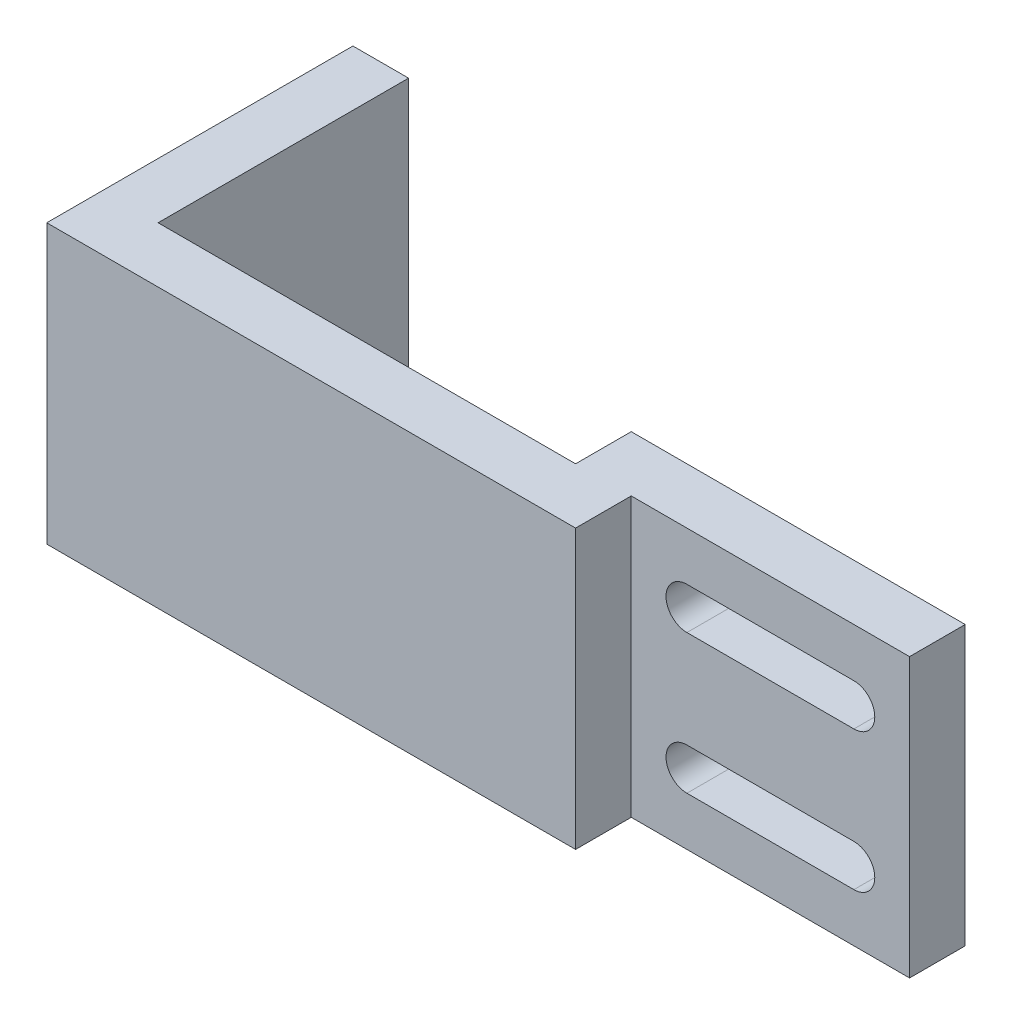
ISO-10303-21;
HEADER;
FILE_DESCRIPTION(('STEP AP214'),'2;1');
FILE_NAME('part.step','',(''),(''),'','','');
FILE_SCHEMA(('AUTOMOTIVE_DESIGN { 1 0 10303 214 1 1 1 1 }'));
ENDSEC;
DATA;
#1=APPLICATION_CONTEXT('core data for automotive mechanical design processes');
#2=APPLICATION_PROTOCOL_DEFINITION('international standard','automotive_design',2000,#1);
#3=PRODUCT_CONTEXT('',#1,'mechanical');
#4=PRODUCT('Part','Part','',(#3));
#5=PRODUCT_RELATED_PRODUCT_CATEGORY('part','',(#4));
#6=PRODUCT_DEFINITION_FORMATION('','',#4);
#7=PRODUCT_DEFINITION_CONTEXT('part definition',#1,'design');
#8=PRODUCT_DEFINITION('design','',#6,#7);
#9=PRODUCT_DEFINITION_SHAPE('','',#8);
#10=(LENGTH_UNIT() NAMED_UNIT(*) SI_UNIT(.MILLI.,.METRE.));
#11=(NAMED_UNIT(*) PLANE_ANGLE_UNIT() SI_UNIT($,.RADIAN.));
#12=(NAMED_UNIT(*) SI_UNIT($,.STERADIAN.) SOLID_ANGLE_UNIT());
#13=UNCERTAINTY_MEASURE_WITH_UNIT(LENGTH_MEASURE(1.E-05),#10,'distance_accuracy_value','');
#14=(GEOMETRIC_REPRESENTATION_CONTEXT(3) GLOBAL_UNCERTAINTY_ASSIGNED_CONTEXT((#13)) GLOBAL_UNIT_ASSIGNED_CONTEXT((#10,
#11,#12)) REPRESENTATION_CONTEXT('',''));
#15=CARTESIAN_POINT('',(0.,0.,0.));
#16=DIRECTION('',(0.,0.,1.));
#17=DIRECTION('',(1.,0.,0.));
#18=AXIS2_PLACEMENT_3D('',#15,#16,#17);
#19=CARTESIAN_POINT('',(-19.,20.,0.));
#20=DIRECTION('',(1.,0.,0.));
#21=DIRECTION('',(0.,0.,-1.));
#22=AXIS2_PLACEMENT_3D('',#19,#20,#21);
#23=PLANE('',#22);
#24=DIRECTION('',(0.,0.,1.));
#25=VECTOR('',#24,1.);
#26=CARTESIAN_POINT('',(-19.,0.,0.));
#27=LINE('',#26,#25);
#28=CARTESIAN_POINT('',(-19.,0.,-22.));
#29=VERTEX_POINT('',#28);
#30=CARTESIAN_POINT('',(-19.,0.,0.));
#31=VERTEX_POINT('',#30);
#32=EDGE_CURVE('E187',#29,#31,#27,.T.);
#33=ORIENTED_EDGE('',*,*,#32,.T.);
#34=DIRECTION('',(0.,-1.,0.));
#35=VECTOR('',#34,1.);
#36=CARTESIAN_POINT('',(-19.,20.,0.));
#37=LINE('',#36,#35);
#38=CARTESIAN_POINT('',(-19.,20.,0.));
#39=VERTEX_POINT('',#38);
#40=EDGE_CURVE('E276',#39,#31,#37,.T.);
#41=ORIENTED_EDGE('',*,*,#40,.F.);
#42=DIRECTION('',(0.,0.,1.));
#43=VECTOR('',#42,1.);
#44=CARTESIAN_POINT('',(-19.,20.,0.));
#45=LINE('',#44,#43);
#46=CARTESIAN_POINT('',(-19.,20.,-22.));
#47=VERTEX_POINT('',#46);
#48=EDGE_CURVE('E208',#47,#39,#45,.T.);
#49=ORIENTED_EDGE('',*,*,#48,.F.);
#50=DIRECTION('',(0.,-1.,0.));
#51=VECTOR('',#50,1.);
#52=CARTESIAN_POINT('',(-19.,20.,-22.));
#53=LINE('',#52,#51);
#54=EDGE_CURVE('E230',#47,#29,#53,.T.);
#55=ORIENTED_EDGE('',*,*,#54,.T.);
#56=EDGE_LOOP('',(#33,#41,#49,#55));
#57=FACE_BOUND('',#56,.T.);
#58=ADVANCED_FACE('F32',(#57),#23,.F.);
#59=CARTESIAN_POINT('',(19.,20.,0.));
#60=DIRECTION('',(0.,0.,-1.));
#61=DIRECTION('',(-1.,0.,0.));
#62=AXIS2_PLACEMENT_3D('',#59,#60,#61);
#63=PLANE('',#62);
#64=DIRECTION('',(1.,0.,0.));
#65=VECTOR('',#64,1.);
#66=CARTESIAN_POINT('',(19.,0.,0.));
#67=LINE('',#66,#65);
#68=CARTESIAN_POINT('',(19.,0.,0.));
#69=VERTEX_POINT('',#68);
#70=EDGE_CURVE('E233',#31,#69,#67,.T.);
#71=ORIENTED_EDGE('',*,*,#70,.T.);
#72=DIRECTION('',(0.,-1.,0.));
#73=VECTOR('',#72,1.);
#74=CARTESIAN_POINT('',(19.,20.,0.));
#75=LINE('',#74,#73);
#76=CARTESIAN_POINT('',(19.,20.,0.));
#77=VERTEX_POINT('',#76);
#78=EDGE_CURVE('E273',#77,#69,#75,.T.);
#79=ORIENTED_EDGE('',*,*,#78,.F.);
#80=DIRECTION('',(1.,0.,0.));
#81=VECTOR('',#80,1.);
#82=CARTESIAN_POINT('',(19.,20.,0.));
#83=LINE('',#82,#81);
#84=EDGE_CURVE('E211',#39,#77,#83,.T.);
#85=ORIENTED_EDGE('',*,*,#84,.F.);
#86=ORIENTED_EDGE('',*,*,#40,.T.);
#87=EDGE_LOOP('',(#71,#79,#85,#86));
#88=FACE_BOUND('',#87,.T.);
#89=ADVANCED_FACE('F315',(#88),#63,.F.);
#90=CARTESIAN_POINT('',(19.,20.,-4.));
#91=DIRECTION('',(-1.,0.,0.));
#92=DIRECTION('',(0.,0.,1.));
#93=AXIS2_PLACEMENT_3D('',#90,#91,#92);
#94=PLANE('',#93);
#95=DIRECTION('',(0.,0.,-1.));
#96=VECTOR('',#95,1.);
#97=CARTESIAN_POINT('',(19.,0.,-4.));
#98=LINE('',#97,#96);
#99=CARTESIAN_POINT('',(19.,0.,-4.));
#100=VERTEX_POINT('',#99);
#101=EDGE_CURVE('E235',#69,#100,#98,.T.);
#102=ORIENTED_EDGE('',*,*,#101,.T.);
#103=DIRECTION('',(0.,-1.,0.));
#104=VECTOR('',#103,1.);
#105=CARTESIAN_POINT('',(19.,20.,-4.));
#106=LINE('',#105,#104);
#107=CARTESIAN_POINT('',(19.,20.,-4.));
#108=VERTEX_POINT('',#107);
#109=EDGE_CURVE('E270',#108,#100,#106,.T.);
#110=ORIENTED_EDGE('',*,*,#109,.F.);
#111=DIRECTION('',(0.,0.,-1.));
#112=VECTOR('',#111,1.);
#113=CARTESIAN_POINT('',(19.,20.,-4.));
#114=LINE('',#113,#112);
#115=EDGE_CURVE('E214',#77,#108,#114,.T.);
#116=ORIENTED_EDGE('',*,*,#115,.F.);
#117=ORIENTED_EDGE('',*,*,#78,.T.);
#118=EDGE_LOOP('',(#102,#110,#116,#117));
#119=FACE_BOUND('',#118,.T.);
#120=ADVANCED_FACE('F320',(#119),#94,.F.);
#121=CARTESIAN_POINT('',(39.,20.,-4.00000000000001));
#122=DIRECTION('',(0.,0.,-1.));
#123=DIRECTION('',(-1.,0.,0.));
#124=AXIS2_PLACEMENT_3D('',#121,#122,#123);
#125=PLANE('',#124);
#126=DIRECTION('',(-1.,0.,0.));
#127=VECTOR('',#126,1.);
#128=CARTESIAN_POINT('',(35.,16.5,-4.));
#129=LINE('',#128,#127);
#130=CARTESIAN_POINT('',(35.,16.5,-4.00000000000001));
#131=VERTEX_POINT('',#130);
#132=CARTESIAN_POINT('',(23.,16.5,-4.));
#133=VERTEX_POINT('',#132);
#134=EDGE_CURVE('E173',#131,#133,#129,.T.);
#135=ORIENTED_EDGE('',*,*,#134,.F.);
#136=CARTESIAN_POINT('',(35.,15.,-4.));
#137=DIRECTION('',(0.,0.,1.));
#138=DIRECTION('',(1.,0.,0.));
#139=AXIS2_PLACEMENT_3D('',#136,#137,#138);
#140=CIRCLE('',#139,1.5);
#141=CARTESIAN_POINT('',(35.,13.5,-4.));
#142=VERTEX_POINT('',#141);
#143=EDGE_CURVE('E46',#142,#131,#140,.T.);
#144=ORIENTED_EDGE('',*,*,#143,.F.);
#145=DIRECTION('',(1.,0.,0.));
#146=VECTOR('',#145,1.);
#147=CARTESIAN_POINT('',(35.,13.5,-4.));
#148=LINE('',#147,#146);
#149=CARTESIAN_POINT('',(23.,13.5,-4.));
#150=VERTEX_POINT('',#149);
#151=EDGE_CURVE('E180',#150,#142,#148,.T.);
#152=ORIENTED_EDGE('',*,*,#151,.F.);
#153=CARTESIAN_POINT('',(23.,15.,-4.));
#154=DIRECTION('',(0.,0.,1.));
#155=DIRECTION('',(-1.,0.,0.));
#156=AXIS2_PLACEMENT_3D('',#153,#154,#155);
#157=CIRCLE('',#156,1.5);
#158=EDGE_CURVE('E163',#133,#150,#157,.T.);
#159=ORIENTED_EDGE('',*,*,#158,.F.);
#160=EDGE_LOOP('',(#135,#144,#152,#159));
#161=FACE_BOUND('',#160,.T.);
#162=DIRECTION('',(-1.,0.,0.));
#163=VECTOR('',#162,1.);
#164=CARTESIAN_POINT('',(35.,6.50000000000001,-4.));
#165=LINE('',#164,#163);
#166=CARTESIAN_POINT('',(35.,6.50000000000001,-4.00000000000001));
#167=VERTEX_POINT('',#166);
#168=CARTESIAN_POINT('',(23.,6.50000000000001,-4.));
#169=VERTEX_POINT('',#168);
#170=EDGE_CURVE('E191',#167,#169,#165,.T.);
#171=ORIENTED_EDGE('',*,*,#170,.F.);
#172=CARTESIAN_POINT('',(35.,5.,-4.));
#173=DIRECTION('',(0.,0.,1.));
#174=DIRECTION('',(-1.,0.,0.));
#175=AXIS2_PLACEMENT_3D('',#172,#173,#174);
#176=CIRCLE('',#175,1.5);
#177=CARTESIAN_POINT('',(35.,3.5,-4.));
#178=VERTEX_POINT('',#177);
#179=EDGE_CURVE('E54',#178,#167,#176,.T.);
#180=ORIENTED_EDGE('',*,*,#179,.F.);
#181=DIRECTION('',(1.,0.,0.));
#182=VECTOR('',#181,1.);
#183=CARTESIAN_POINT('',(35.,3.5,-4.));
#184=LINE('',#183,#182);
#185=CARTESIAN_POINT('',(23.,3.5,-4.));
#186=VERTEX_POINT('',#185);
#187=EDGE_CURVE('E197',#186,#178,#184,.T.);
#188=ORIENTED_EDGE('',*,*,#187,.F.);
#189=CARTESIAN_POINT('',(23.,5.,-4.));
#190=DIRECTION('',(0.,0.,1.));
#191=DIRECTION('',(1.,0.,0.));
#192=AXIS2_PLACEMENT_3D('',#189,#190,#191);
#193=CIRCLE('',#192,1.5);
#194=EDGE_CURVE('E194',#169,#186,#193,.T.);
#195=ORIENTED_EDGE('',*,*,#194,.F.);
#196=EDGE_LOOP('',(#171,#180,#188,#195));
#197=FACE_BOUND('',#196,.T.);
#198=DIRECTION('',(1.,0.,0.));
#199=VECTOR('',#198,1.);
#200=CARTESIAN_POINT('',(39.,0.,-4.00000000000001));
#201=LINE('',#200,#199);
#202=CARTESIAN_POINT('',(39.,0.,-4.00000000000001));
#203=VERTEX_POINT('',#202);
#204=EDGE_CURVE('E237',#100,#203,#201,.T.);
#205=ORIENTED_EDGE('',*,*,#204,.T.);
#206=DIRECTION('',(0.,-1.,0.));
#207=VECTOR('',#206,1.);
#208=CARTESIAN_POINT('',(39.,20.,-4.00000000000001));
#209=LINE('',#208,#207);
#210=CARTESIAN_POINT('',(39.,20.,-4.00000000000001));
#211=VERTEX_POINT('',#210);
#212=EDGE_CURVE('E267',#211,#203,#209,.T.);
#213=ORIENTED_EDGE('',*,*,#212,.F.);
#214=DIRECTION('',(1.,0.,0.));
#215=VECTOR('',#214,1.);
#216=CARTESIAN_POINT('',(39.,20.,-4.00000000000001));
#217=LINE('',#216,#215);
#218=EDGE_CURVE('E216',#108,#211,#217,.T.);
#219=ORIENTED_EDGE('',*,*,#218,.F.);
#220=ORIENTED_EDGE('',*,*,#109,.T.);
#221=EDGE_LOOP('',(#205,#213,#219,#220));
#222=FACE_BOUND('',#221,.T.);
#223=ADVANCED_FACE('F177',(#161,#197,#222),#125,.F.);
#224=CARTESIAN_POINT('',(39.,20.,-8.00000000000001));
#225=DIRECTION('',(-1.,0.,0.));
#226=DIRECTION('',(0.,0.,1.));
#227=AXIS2_PLACEMENT_3D('',#224,#225,#226);
#228=PLANE('',#227);
#229=DIRECTION('',(0.,0.,-1.));
#230=VECTOR('',#229,1.);
#231=CARTESIAN_POINT('',(39.,0.,-8.00000000000001));
#232=LINE('',#231,#230);
#233=CARTESIAN_POINT('',(39.,0.,-8.00000000000001));
#234=VERTEX_POINT('',#233);
#235=EDGE_CURVE('E239',#203,#234,#232,.T.);
#236=ORIENTED_EDGE('',*,*,#235,.T.);
#237=DIRECTION('',(0.,-1.,0.));
#238=VECTOR('',#237,1.);
#239=CARTESIAN_POINT('',(39.,20.,-8.00000000000001));
#240=LINE('',#239,#238);
#241=CARTESIAN_POINT('',(39.,20.,-8.00000000000001));
#242=VERTEX_POINT('',#241);
#243=EDGE_CURVE('E264',#242,#234,#240,.T.);
#244=ORIENTED_EDGE('',*,*,#243,.F.);
#245=DIRECTION('',(0.,0.,-1.));
#246=VECTOR('',#245,1.);
#247=CARTESIAN_POINT('',(39.,20.,-8.00000000000001));
#248=LINE('',#247,#246);
#249=EDGE_CURVE('E218',#211,#242,#248,.T.);
#250=ORIENTED_EDGE('',*,*,#249,.F.);
#251=ORIENTED_EDGE('',*,*,#212,.T.);
#252=EDGE_LOOP('',(#236,#244,#250,#251));
#253=FACE_BOUND('',#252,.T.);
#254=ADVANCED_FACE('F360',(#253),#228,.F.);
#255=CARTESIAN_POINT('',(15.,20.,-8.00000000000001));
#256=DIRECTION('',(0.,0.,1.));
#257=DIRECTION('',(1.,0.,0.));
#258=AXIS2_PLACEMENT_3D('',#255,#256,#257);
#259=PLANE('',#258);
#260=DIRECTION('',(1.,0.,0.));
#261=VECTOR('',#260,1.);
#262=CARTESIAN_POINT('',(15.,13.5,-8.00000000000001));
#263=LINE('',#262,#261);
#264=CARTESIAN_POINT('',(23.,13.5,-8.00000000000001));
#265=VERTEX_POINT('',#264);
#266=CARTESIAN_POINT('',(35.,13.5,-8.00000000000001));
#267=VERTEX_POINT('',#266);
#268=EDGE_CURVE('E39',#265,#267,#263,.T.);
#269=ORIENTED_EDGE('',*,*,#268,.T.);
#270=CARTESIAN_POINT('',(35.,15.,-8.00000000000001));
#271=DIRECTION('',(0.,0.,1.));
#272=DIRECTION('',(1.,0.,0.));
#273=AXIS2_PLACEMENT_3D('',#270,#271,#272);
#274=CIRCLE('',#273,1.5);
#275=CARTESIAN_POINT('',(35.,16.5,-8.00000000000001));
#276=VERTEX_POINT('',#275);
#277=EDGE_CURVE('E11',#267,#276,#274,.T.);
#278=ORIENTED_EDGE('',*,*,#277,.T.);
#279=DIRECTION('',(-1.,0.,0.));
#280=VECTOR('',#279,1.);
#281=CARTESIAN_POINT('',(15.,16.5,-8.00000000000001));
#282=LINE('',#281,#280);
#283=CARTESIAN_POINT('',(23.,16.5,-8.00000000000001));
#284=VERTEX_POINT('',#283);
#285=EDGE_CURVE('E291',#276,#284,#282,.T.);
#286=ORIENTED_EDGE('',*,*,#285,.T.);
#287=CARTESIAN_POINT('',(23.,15.,-8.00000000000001));
#288=DIRECTION('',(0.,0.,1.));
#289=DIRECTION('',(1.,0.,0.));
#290=AXIS2_PLACEMENT_3D('',#287,#288,#289);
#291=CIRCLE('',#290,1.5);
#292=EDGE_CURVE('E166',#284,#265,#291,.T.);
#293=ORIENTED_EDGE('',*,*,#292,.T.);
#294=EDGE_LOOP('',(#269,#278,#286,#293));
#295=FACE_BOUND('',#294,.T.);
#296=DIRECTION('',(1.,0.,0.));
#297=VECTOR('',#296,1.);
#298=CARTESIAN_POINT('',(15.,3.5,-8.00000000000001));
#299=LINE('',#298,#297);
#300=CARTESIAN_POINT('',(23.,3.5,-8.00000000000001));
#301=VERTEX_POINT('',#300);
#302=CARTESIAN_POINT('',(35.,3.5,-8.00000000000001));
#303=VERTEX_POINT('',#302);
#304=EDGE_CURVE('E285',#301,#303,#299,.T.);
#305=ORIENTED_EDGE('',*,*,#304,.T.);
#306=CARTESIAN_POINT('',(35.,5.,-8.00000000000001));
#307=DIRECTION('',(0.,0.,1.));
#308=DIRECTION('',(1.,0.,0.));
#309=AXIS2_PLACEMENT_3D('',#306,#307,#308);
#310=CIRCLE('',#309,1.5);
#311=CARTESIAN_POINT('',(35.,6.50000000000001,-8.00000000000001));
#312=VERTEX_POINT('',#311);
#313=EDGE_CURVE('E288',#303,#312,#310,.T.);
#314=ORIENTED_EDGE('',*,*,#313,.T.);
#315=DIRECTION('',(-1.,0.,0.));
#316=VECTOR('',#315,1.);
#317=CARTESIAN_POINT('',(15.,6.50000000000001,-8.00000000000001));
#318=LINE('',#317,#316);
#319=CARTESIAN_POINT('',(23.,6.50000000000001,-8.00000000000001));
#320=VERTEX_POINT('',#319);
#321=EDGE_CURVE('E279',#312,#320,#318,.T.);
#322=ORIENTED_EDGE('',*,*,#321,.T.);
#323=CARTESIAN_POINT('',(23.,5.,-8.00000000000001));
#324=DIRECTION('',(0.,0.,1.));
#325=DIRECTION('',(1.,0.,0.));
#326=AXIS2_PLACEMENT_3D('',#323,#324,#325);
#327=CIRCLE('',#326,1.5);
#328=EDGE_CURVE('E282',#320,#301,#327,.T.);
#329=ORIENTED_EDGE('',*,*,#328,.T.);
#330=EDGE_LOOP('',(#305,#314,#322,#329));
#331=FACE_BOUND('',#330,.T.);
#332=DIRECTION('',(-1.,0.,0.));
#333=VECTOR('',#332,1.);
#334=CARTESIAN_POINT('',(15.,0.,-8.00000000000001));
#335=LINE('',#334,#333);
#336=CARTESIAN_POINT('',(15.,0.,-8.00000000000001));
#337=VERTEX_POINT('',#336);
#338=EDGE_CURVE('E241',#234,#337,#335,.T.);
#339=ORIENTED_EDGE('',*,*,#338,.T.);
#340=DIRECTION('',(0.,-1.,0.));
#341=VECTOR('',#340,1.);
#342=CARTESIAN_POINT('',(15.,20.,-8.00000000000001));
#343=LINE('',#342,#341);
#344=CARTESIAN_POINT('',(15.,20.,-8.00000000000001));
#345=VERTEX_POINT('',#344);
#346=EDGE_CURVE('E261',#345,#337,#343,.T.);
#347=ORIENTED_EDGE('',*,*,#346,.F.);
#348=DIRECTION('',(-1.,0.,0.));
#349=VECTOR('',#348,1.);
#350=CARTESIAN_POINT('',(15.,20.,-8.00000000000001));
#351=LINE('',#350,#349);
#352=EDGE_CURVE('E220',#242,#345,#351,.T.);
#353=ORIENTED_EDGE('',*,*,#352,.F.);
#354=ORIENTED_EDGE('',*,*,#243,.T.);
#355=EDGE_LOOP('',(#339,#347,#353,#354));
#356=FACE_BOUND('',#355,.T.);
#357=ADVANCED_FACE('F295',(#295,#331,#356),#259,.F.);
#358=CARTESIAN_POINT('',(15.,20.,-4.));
#359=DIRECTION('',(1.,0.,0.));
#360=DIRECTION('',(0.,0.,-1.));
#361=AXIS2_PLACEMENT_3D('',#358,#359,#360);
#362=PLANE('',#361);
#363=DIRECTION('',(0.,0.,1.));
#364=VECTOR('',#363,1.);
#365=CARTESIAN_POINT('',(15.,0.,-4.));
#366=LINE('',#365,#364);
#367=CARTESIAN_POINT('',(15.,0.,-4.));
#368=VERTEX_POINT('',#367);
#369=EDGE_CURVE('E243',#337,#368,#366,.T.);
#370=ORIENTED_EDGE('',*,*,#369,.T.);
#371=DIRECTION('',(0.,-1.,0.));
#372=VECTOR('',#371,1.);
#373=CARTESIAN_POINT('',(15.,20.,-4.));
#374=LINE('',#373,#372);
#375=CARTESIAN_POINT('',(15.,20.,-4.));
#376=VERTEX_POINT('',#375);
#377=EDGE_CURVE('E258',#376,#368,#374,.T.);
#378=ORIENTED_EDGE('',*,*,#377,.F.);
#379=DIRECTION('',(0.,0.,1.));
#380=VECTOR('',#379,1.);
#381=CARTESIAN_POINT('',(15.,20.,-4.));
#382=LINE('',#381,#380);
#383=EDGE_CURVE('E222',#345,#376,#382,.T.);
#384=ORIENTED_EDGE('',*,*,#383,.F.);
#385=ORIENTED_EDGE('',*,*,#346,.T.);
#386=EDGE_LOOP('',(#370,#378,#384,#385));
#387=FACE_BOUND('',#386,.T.);
#388=ADVANCED_FACE('F353',(#387),#362,.F.);
#389=CARTESIAN_POINT('',(-15.,20.,-4.));
#390=DIRECTION('',(0.,0.,1.));
#391=DIRECTION('',(1.,0.,0.));
#392=AXIS2_PLACEMENT_3D('',#389,#390,#391);
#393=PLANE('',#392);
#394=DIRECTION('',(-1.,0.,0.));
#395=VECTOR('',#394,1.);
#396=CARTESIAN_POINT('',(-15.,0.,-4.));
#397=LINE('',#396,#395);
#398=CARTESIAN_POINT('',(-15.,0.,-4.));
#399=VERTEX_POINT('',#398);
#400=EDGE_CURVE('E245',#368,#399,#397,.T.);
#401=ORIENTED_EDGE('',*,*,#400,.T.);
#402=DIRECTION('',(0.,-1.,0.));
#403=VECTOR('',#402,1.);
#404=CARTESIAN_POINT('',(-15.,20.,-4.));
#405=LINE('',#404,#403);
#406=CARTESIAN_POINT('',(-15.,20.,-4.));
#407=VERTEX_POINT('',#406);
#408=EDGE_CURVE('E255',#407,#399,#405,.T.);
#409=ORIENTED_EDGE('',*,*,#408,.F.);
#410=DIRECTION('',(-1.,0.,0.));
#411=VECTOR('',#410,1.);
#412=CARTESIAN_POINT('',(-15.,20.,-4.));
#413=LINE('',#412,#411);
#414=EDGE_CURVE('E224',#376,#407,#413,.T.);
#415=ORIENTED_EDGE('',*,*,#414,.F.);
#416=ORIENTED_EDGE('',*,*,#377,.T.);
#417=EDGE_LOOP('',(#401,#409,#415,#416));
#418=FACE_BOUND('',#417,.T.);
#419=ADVANCED_FACE('F348',(#418),#393,.F.);
#420=CARTESIAN_POINT('',(-15.,20.,-22.));
#421=DIRECTION('',(-1.,0.,0.));
#422=DIRECTION('',(0.,0.,1.));
#423=AXIS2_PLACEMENT_3D('',#420,#421,#422);
#424=PLANE('',#423);
#425=DIRECTION('',(0.,0.,-1.));
#426=VECTOR('',#425,1.);
#427=CARTESIAN_POINT('',(-15.,0.,-22.));
#428=LINE('',#427,#426);
#429=CARTESIAN_POINT('',(-15.,0.,-22.));
#430=VERTEX_POINT('',#429);
#431=EDGE_CURVE('E247',#399,#430,#428,.T.);
#432=ORIENTED_EDGE('',*,*,#431,.T.);
#433=DIRECTION('',(0.,-1.,0.));
#434=VECTOR('',#433,1.);
#435=CARTESIAN_POINT('',(-15.,20.,-22.));
#436=LINE('',#435,#434);
#437=CARTESIAN_POINT('',(-15.,20.,-22.));
#438=VERTEX_POINT('',#437);
#439=EDGE_CURVE('E252',#438,#430,#436,.T.);
#440=ORIENTED_EDGE('',*,*,#439,.F.);
#441=DIRECTION('',(0.,0.,-1.));
#442=VECTOR('',#441,1.);
#443=CARTESIAN_POINT('',(-15.,20.,-22.));
#444=LINE('',#443,#442);
#445=EDGE_CURVE('E226',#407,#438,#444,.T.);
#446=ORIENTED_EDGE('',*,*,#445,.F.);
#447=ORIENTED_EDGE('',*,*,#408,.T.);
#448=EDGE_LOOP('',(#432,#440,#446,#447));
#449=FACE_BOUND('',#448,.T.);
#450=ADVANCED_FACE('F342',(#449),#424,.F.);
#451=CARTESIAN_POINT('',(-19.,20.,-22.));
#452=DIRECTION('',(0.,0.,1.));
#453=DIRECTION('',(1.,0.,0.));
#454=AXIS2_PLACEMENT_3D('',#451,#452,#453);
#455=PLANE('',#454);
#456=DIRECTION('',(-1.,0.,0.));
#457=VECTOR('',#456,1.);
#458=CARTESIAN_POINT('',(-19.,0.,-22.));
#459=LINE('',#458,#457);
#460=EDGE_CURVE('E212',#430,#29,#459,.T.);
#461=ORIENTED_EDGE('',*,*,#460,.T.);
#462=ORIENTED_EDGE('',*,*,#54,.F.);
#463=DIRECTION('',(-1.,0.,0.));
#464=VECTOR('',#463,1.);
#465=CARTESIAN_POINT('',(-19.,20.,-22.));
#466=LINE('',#465,#464);
#467=EDGE_CURVE('E228',#438,#47,#466,.T.);
#468=ORIENTED_EDGE('',*,*,#467,.F.);
#469=ORIENTED_EDGE('',*,*,#439,.T.);
#470=EDGE_LOOP('',(#461,#462,#468,#469));
#471=FACE_BOUND('',#470,.T.);
#472=ADVANCED_FACE('F340',(#471),#455,.F.);
#473=CARTESIAN_POINT('',(0.,20.,0.));
#474=DIRECTION('',(0.,-1.,0.));
#475=DIRECTION('',(0.,0.,-1.));
#476=AXIS2_PLACEMENT_3D('',#473,#474,#475);
#477=PLANE('',#476);
#478=ORIENTED_EDGE('',*,*,#48,.T.);
#479=ORIENTED_EDGE('',*,*,#84,.T.);
#480=ORIENTED_EDGE('',*,*,#115,.T.);
#481=ORIENTED_EDGE('',*,*,#218,.T.);
#482=ORIENTED_EDGE('',*,*,#249,.T.);
#483=ORIENTED_EDGE('',*,*,#352,.T.);
#484=ORIENTED_EDGE('',*,*,#383,.T.);
#485=ORIENTED_EDGE('',*,*,#414,.T.);
#486=ORIENTED_EDGE('',*,*,#445,.T.);
#487=ORIENTED_EDGE('',*,*,#467,.T.);
#488=EDGE_LOOP('',(#478,#479,#480,#481,#482,#483,#484,#485,#486,#487));
#489=FACE_BOUND('',#488,.T.);
#490=ADVANCED_FACE('F335',(#489),#477,.F.);
#491=CARTESIAN_POINT('',(0.,0.,0.));
#492=DIRECTION('',(0.,-1.,0.));
#493=DIRECTION('',(0.,0.,-1.));
#494=AXIS2_PLACEMENT_3D('',#491,#492,#493);
#495=PLANE('',#494);
#496=ORIENTED_EDGE('',*,*,#32,.F.);
#497=ORIENTED_EDGE('',*,*,#460,.F.);
#498=ORIENTED_EDGE('',*,*,#431,.F.);
#499=ORIENTED_EDGE('',*,*,#400,.F.);
#500=ORIENTED_EDGE('',*,*,#369,.F.);
#501=ORIENTED_EDGE('',*,*,#338,.F.);
#502=ORIENTED_EDGE('',*,*,#235,.F.);
#503=ORIENTED_EDGE('',*,*,#204,.F.);
#504=ORIENTED_EDGE('',*,*,#101,.F.);
#505=ORIENTED_EDGE('',*,*,#70,.F.);
#506=EDGE_LOOP('',(#496,#497,#498,#499,#500,#501,#502,#503,#504,#505));
#507=FACE_BOUND('',#506,.T.);
#508=ADVANCED_FACE('F328',(#507),#495,.T.);
#509=CARTESIAN_POINT('',(35.,5.,-24.));
#510=DIRECTION('',(0.,0.,1.));
#511=DIRECTION('',(1.,0.,0.));
#512=AXIS2_PLACEMENT_3D('',#509,#510,#511);
#513=CYLINDRICAL_SURFACE('',#512,1.5);
#514=DIRECTION('',(0.,0.,1.));
#515=VECTOR('',#514,1.);
#516=CARTESIAN_POINT('',(35.,3.5,-24.));
#517=LINE('',#516,#515);
#518=EDGE_CURVE('E201',#303,#178,#517,.T.);
#519=ORIENTED_EDGE('',*,*,#518,.T.);
#520=ORIENTED_EDGE('',*,*,#179,.T.);
#521=DIRECTION('',(0.,0.,1.));
#522=VECTOR('',#521,1.);
#523=CARTESIAN_POINT('',(35.,6.50000000000001,-24.));
#524=LINE('',#523,#522);
#525=EDGE_CURVE('E200',#312,#167,#524,.T.);
#526=ORIENTED_EDGE('',*,*,#525,.F.);
#527=ORIENTED_EDGE('',*,*,#313,.F.);
#528=EDGE_LOOP('',(#519,#520,#526,#527));
#529=FACE_BOUND('',#528,.T.);
#530=ADVANCED_FACE('F388',(#529),#513,.F.);
#531=CARTESIAN_POINT('',(35.,3.5,-24.));
#532=DIRECTION('',(0.,-1.,0.));
#533=DIRECTION('',(1.,0.,0.));
#534=AXIS2_PLACEMENT_3D('',#531,#532,#533);
#535=PLANE('',#534);
#536=DIRECTION('',(0.,0.,1.));
#537=VECTOR('',#536,1.);
#538=CARTESIAN_POINT('',(23.,3.5,-24.));
#539=LINE('',#538,#537);
#540=EDGE_CURVE('E203',#301,#186,#539,.T.);
#541=ORIENTED_EDGE('',*,*,#540,.T.);
#542=ORIENTED_EDGE('',*,*,#187,.T.);
#543=ORIENTED_EDGE('',*,*,#518,.F.);
#544=ORIENTED_EDGE('',*,*,#304,.F.);
#545=EDGE_LOOP('',(#541,#542,#543,#544));
#546=FACE_BOUND('',#545,.T.);
#547=ADVANCED_FACE('F392',(#546),#535,.F.);
#548=CARTESIAN_POINT('',(23.,5.,-24.));
#549=DIRECTION('',(0.,0.,1.));
#550=DIRECTION('',(1.,0.,0.));
#551=AXIS2_PLACEMENT_3D('',#548,#549,#550);
#552=CYLINDRICAL_SURFACE('',#551,1.5);
#553=DIRECTION('',(0.,0.,1.));
#554=VECTOR('',#553,1.);
#555=CARTESIAN_POINT('',(23.,6.50000000000001,-24.));
#556=LINE('',#555,#554);
#557=EDGE_CURVE('E205',#320,#169,#556,.T.);
#558=ORIENTED_EDGE('',*,*,#557,.T.);
#559=ORIENTED_EDGE('',*,*,#194,.T.);
#560=ORIENTED_EDGE('',*,*,#540,.F.);
#561=ORIENTED_EDGE('',*,*,#328,.F.);
#562=EDGE_LOOP('',(#558,#559,#560,#561));
#563=FACE_BOUND('',#562,.T.);
#564=ADVANCED_FACE('F309',(#563),#552,.F.);
#565=CARTESIAN_POINT('',(35.,6.50000000000001,-24.));
#566=DIRECTION('',(0.,1.,0.));
#567=DIRECTION('',(-1.,0.,0.));
#568=AXIS2_PLACEMENT_3D('',#565,#566,#567);
#569=PLANE('',#568);
#570=ORIENTED_EDGE('',*,*,#525,.T.);
#571=ORIENTED_EDGE('',*,*,#170,.T.);
#572=ORIENTED_EDGE('',*,*,#557,.F.);
#573=ORIENTED_EDGE('',*,*,#321,.F.);
#574=EDGE_LOOP('',(#570,#571,#572,#573));
#575=FACE_BOUND('',#574,.T.);
#576=ADVANCED_FACE('F302',(#575),#569,.F.);
#577=CARTESIAN_POINT('',(35.,15.,-24.));
#578=DIRECTION('',(0.,0.,1.));
#579=DIRECTION('',(1.,0.,0.));
#580=AXIS2_PLACEMENT_3D('',#577,#578,#579);
#581=CYLINDRICAL_SURFACE('',#580,1.5);
#582=DIRECTION('',(0.,0.,1.));
#583=VECTOR('',#582,1.);
#584=CARTESIAN_POINT('',(35.,13.5,-24.));
#585=LINE('',#584,#583);
#586=EDGE_CURVE('E185',#267,#142,#585,.T.);
#587=ORIENTED_EDGE('',*,*,#586,.T.);
#588=ORIENTED_EDGE('',*,*,#143,.T.);
#589=DIRECTION('',(0.,0.,1.));
#590=VECTOR('',#589,1.);
#591=CARTESIAN_POINT('',(35.,16.5,-24.));
#592=LINE('',#591,#590);
#593=EDGE_CURVE('E170',#276,#131,#592,.T.);
#594=ORIENTED_EDGE('',*,*,#593,.F.);
#595=ORIENTED_EDGE('',*,*,#277,.F.);
#596=EDGE_LOOP('',(#587,#588,#594,#595));
#597=FACE_BOUND('',#596,.T.);
#598=ADVANCED_FACE('F300',(#597),#581,.F.);
#599=CARTESIAN_POINT('',(35.,13.5,-24.));
#600=DIRECTION('',(0.,-1.,0.));
#601=DIRECTION('',(1.,0.,0.));
#602=AXIS2_PLACEMENT_3D('',#599,#600,#601);
#603=PLANE('',#602);
#604=DIRECTION('',(0.,0.,1.));
#605=VECTOR('',#604,1.);
#606=CARTESIAN_POINT('',(23.,13.5,-24.));
#607=LINE('',#606,#605);
#608=EDGE_CURVE('E169',#265,#150,#607,.T.);
#609=ORIENTED_EDGE('',*,*,#608,.T.);
#610=ORIENTED_EDGE('',*,*,#151,.T.);
#611=ORIENTED_EDGE('',*,*,#586,.F.);
#612=ORIENTED_EDGE('',*,*,#268,.F.);
#613=EDGE_LOOP('',(#609,#610,#611,#612));
#614=FACE_BOUND('',#613,.T.);
#615=ADVANCED_FACE('F299',(#614),#603,.F.);
#616=CARTESIAN_POINT('',(23.,15.,-24.));
#617=DIRECTION('',(0.,0.,1.));
#618=DIRECTION('',(1.,0.,0.));
#619=AXIS2_PLACEMENT_3D('',#616,#617,#618);
#620=CYLINDRICAL_SURFACE('',#619,1.5);
#621=DIRECTION('',(0.,0.,1.));
#622=VECTOR('',#621,1.);
#623=CARTESIAN_POINT('',(23.,16.5,-24.));
#624=LINE('',#623,#622);
#625=EDGE_CURVE('E158',#284,#133,#624,.T.);
#626=ORIENTED_EDGE('',*,*,#625,.T.);
#627=ORIENTED_EDGE('',*,*,#158,.T.);
#628=ORIENTED_EDGE('',*,*,#608,.F.);
#629=ORIENTED_EDGE('',*,*,#292,.F.);
#630=EDGE_LOOP('',(#626,#627,#628,#629));
#631=FACE_BOUND('',#630,.T.);
#632=ADVANCED_FACE('F160',(#631),#620,.F.);
#633=CARTESIAN_POINT('',(35.,16.5,-24.));
#634=DIRECTION('',(0.,1.,0.));
#635=DIRECTION('',(-1.,0.,0.));
#636=AXIS2_PLACEMENT_3D('',#633,#634,#635);
#637=PLANE('',#636);
#638=ORIENTED_EDGE('',*,*,#593,.T.);
#639=ORIENTED_EDGE('',*,*,#134,.T.);
#640=ORIENTED_EDGE('',*,*,#625,.F.);
#641=ORIENTED_EDGE('',*,*,#285,.F.);
#642=EDGE_LOOP('',(#638,#639,#640,#641));
#643=FACE_BOUND('',#642,.T.);
#644=ADVANCED_FACE('F174',(#643),#637,.F.);
#645=CLOSED_SHELL('',(#58,#89,#120,#223,#254,#357,#388,#419,#450,#472,#490,#508,#530,#547,#564,
#576,#598,#615,#632,#644));
#646=MANIFOLD_SOLID_BREP('B2',#645);
#647=ADVANCED_BREP_SHAPE_REPRESENTATION('',(#18,#646),#14);
#648=SHAPE_DEFINITION_REPRESENTATION(#9,#647);
ENDSEC;
END-ISO-10303-21;
